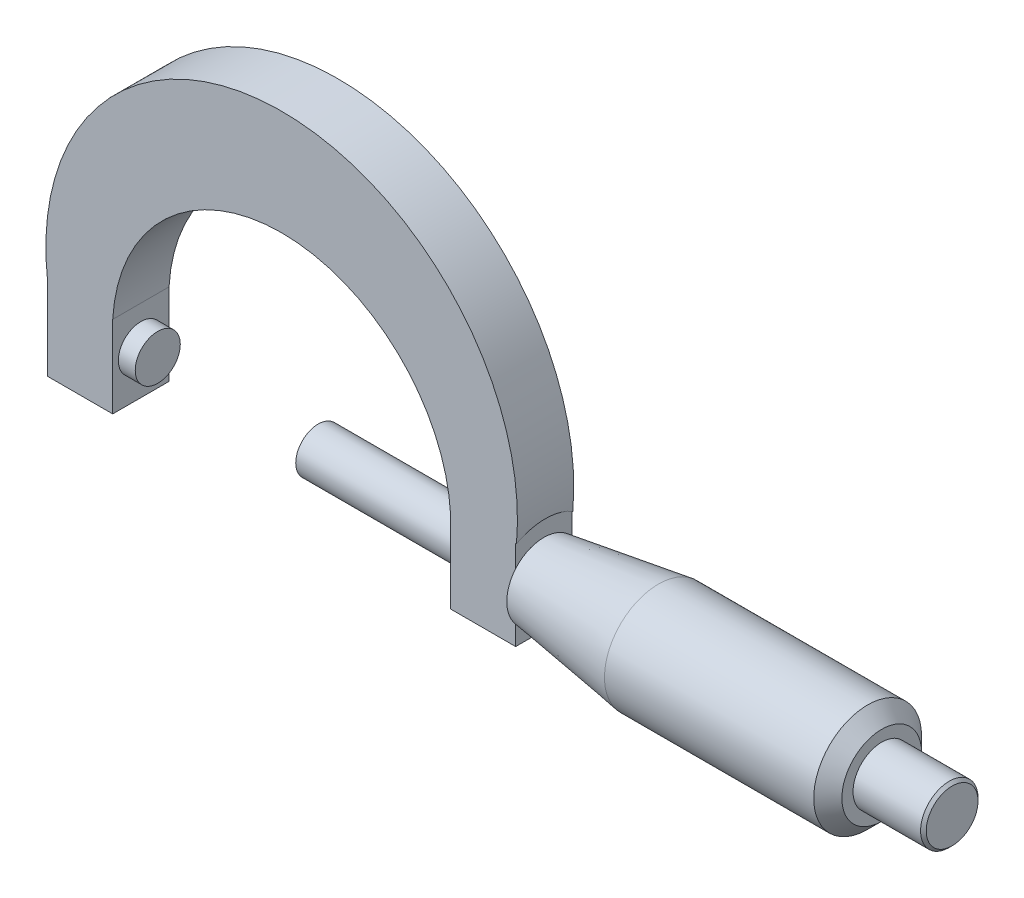
ISO-10303-21;
HEADER;
FILE_DESCRIPTION(('STEP AP214'),'2;1');
FILE_NAME('part.step','',(''),(''),'','','');
FILE_SCHEMA(('AUTOMOTIVE_DESIGN { 1 0 10303 214 1 1 1 1 }'));
ENDSEC;
DATA;
#1=APPLICATION_CONTEXT('core data for automotive mechanical design processes');
#2=APPLICATION_PROTOCOL_DEFINITION('international standard','automotive_design',2000,#1);
#3=PRODUCT_CONTEXT('',#1,'mechanical');
#4=PRODUCT('Part','Part','',(#3));
#5=PRODUCT_RELATED_PRODUCT_CATEGORY('part','',(#4));
#6=PRODUCT_DEFINITION_FORMATION('','',#4);
#7=PRODUCT_DEFINITION_CONTEXT('part definition',#1,'design');
#8=PRODUCT_DEFINITION('design','',#6,#7);
#9=PRODUCT_DEFINITION_SHAPE('','',#8);
#10=(LENGTH_UNIT() NAMED_UNIT(*) SI_UNIT(.MILLI.,.METRE.));
#11=(NAMED_UNIT(*) PLANE_ANGLE_UNIT() SI_UNIT($,.RADIAN.));
#12=(NAMED_UNIT(*) SI_UNIT($,.STERADIAN.) SOLID_ANGLE_UNIT());
#13=UNCERTAINTY_MEASURE_WITH_UNIT(LENGTH_MEASURE(1.E-05),#10,'distance_accuracy_value','');
#14=(GEOMETRIC_REPRESENTATION_CONTEXT(3) GLOBAL_UNCERTAINTY_ASSIGNED_CONTEXT((#13)) GLOBAL_UNIT_ASSIGNED_CONTEXT((#10,
#11,#12)) REPRESENTATION_CONTEXT('',''));
#15=CARTESIAN_POINT('',(0.,0.,0.));
#16=DIRECTION('',(0.,0.,1.));
#17=DIRECTION('',(1.,0.,0.));
#18=AXIS2_PLACEMENT_3D('',#15,#16,#17);
#19=CARTESIAN_POINT('',(21.1105102041848,0.,0.));
#20=DIRECTION('',(1.,0.,0.));
#21=DIRECTION('',(0.,0.,-1.));
#22=AXIS2_PLACEMENT_3D('',#19,#20,#21);
#23=PLANE('',#22);
#24=DIRECTION('',(0.,-1.,0.));
#25=VECTOR('',#24,1.);
#26=CARTESIAN_POINT('',(21.1105102041848,-3.91655101886085,2.53999999999999));
#27=LINE('',#26,#25);
#28=CARTESIAN_POINT('',(21.1105102041848,2.17259672592934,2.53999999999999));
#29=VERTEX_POINT('',#28);
#30=CARTESIAN_POINT('',(21.1105102041848,-2.17259672592934,2.53999999999999));
#31=VERTEX_POINT('',#30);
#32=EDGE_CURVE('E192',#29,#31,#27,.T.);
#33=ORIENTED_EDGE('',*,*,#32,.T.);
#34=CARTESIAN_POINT('',(21.1105102041848,0.,0.));
#35=DIRECTION('',(1.,0.,0.));
#36=DIRECTION('',(0.,0.,-1.));
#37=AXIS2_PLACEMENT_3D('',#34,#35,#36);
#38=CIRCLE('',#37,3.34242075949737);
#39=EDGE_CURVE('E149',#31,#29,#38,.F.);
#40=ORIENTED_EDGE('',*,*,#39,.T.);
#41=EDGE_LOOP('',(#33,#40));
#42=FACE_BOUND('',#41,.T.);
#43=ADVANCED_FACE('F48',(#42),#23,.F.);
#44=DIRECTION('',(0.,-1.,0.));
#45=VECTOR('',#44,1.);
#46=CARTESIAN_POINT('',(21.1105102041848,-3.91655101886085,-2.53999999999999));
#47=LINE('',#46,#45);
#48=CARTESIAN_POINT('',(21.1105102041848,2.17259672592934,-2.53999999999999));
#49=VERTEX_POINT('',#48);
#50=CARTESIAN_POINT('',(21.1105102041848,-2.17259672592934,-2.53999999999999));
#51=VERTEX_POINT('',#50);
#52=EDGE_CURVE('E162',#49,#51,#47,.T.);
#53=ORIENTED_EDGE('',*,*,#52,.F.);
#54=EDGE_CURVE('E141',#49,#51,#38,.F.);
#55=ORIENTED_EDGE('',*,*,#54,.T.);
#56=EDGE_LOOP('',(#53,#55));
#57=FACE_BOUND('',#56,.T.);
#58=ADVANCED_FACE('F163',(#57),#23,.F.);
#59=CARTESIAN_POINT('',(0.,6.08361904921517,2.53999999999999));
#60=DIRECTION('',(0.,0.,-1.));
#61=DIRECTION('',(-1.,0.,0.));
#62=AXIS2_PLACEMENT_3D('',#59,#60,#61);
#63=CYLINDRICAL_SURFACE('',#62,21.2716639108442);
#64=CARTESIAN_POINT('',(21.1835693484904,4.14969164788681,-2.53999999999999));
#65=CARTESIAN_POINT('',(21.1900594321899,4.22084179336612,-2.4237895843987));
#66=CARTESIAN_POINT('',(21.1957521620569,4.28710102614201,-2.30454559752916));
#67=CARTESIAN_POINT('',(21.2057660920018,4.40940344393565,-2.06088371676479));
#68=CARTESIAN_POINT('',(21.2100873902017,4.46544735970749,-1.93646619374216));
#69=CARTESIAN_POINT('',(21.217578525215,4.566841433471,-1.6834678172283));
#70=CARTESIAN_POINT('',(21.2207495783246,4.61220286945297,-1.55489151899811));
#71=CARTESIAN_POINT('',(21.2261310367689,4.69198297696004,-1.29436958269521));
#72=CARTESIAN_POINT('',(21.2283414498489,4.72640173671258,-1.1624239717975));
#73=CARTESIAN_POINT('',(21.2319486009122,4.78405053126495,-0.896085379426133));
#74=CARTESIAN_POINT('',(21.2333452529681,4.80727938444812,-0.761692141045593));
#75=CARTESIAN_POINT('',(21.2354262515351,4.84238268823947,-0.491378078538447));
#76=CARTESIAN_POINT('',(21.2361103506572,4.85425319526546,-0.355456740419877));
#77=CARTESIAN_POINT('',(21.2368181706322,4.86654157270807,-0.0830773739447107));
#78=CARTESIAN_POINT('',(21.2368418028732,4.86695790636813,0.0533807239703093));
#79=CARTESIAN_POINT('',(21.2362303107757,4.85633105646733,0.325848540945894));
#80=CARTESIAN_POINT('',(21.2355951862726,4.84528787004251,0.461858259894392));
#81=CARTESIAN_POINT('',(21.2336146602867,4.8117794868267,0.732802056394959));
#82=CARTESIAN_POINT('',(21.232267494618,4.78928592518832,0.867732613481041));
#83=CARTESIAN_POINT('',(21.2287634235388,4.7330333626168,1.13516490620752));
#84=CARTESIAN_POINT('',(21.226606807464,4.6992783875213,1.26766749199037));
#85=CARTESIAN_POINT('',(21.2213424472608,4.62079511828172,1.52918662586984));
#86=CARTESIAN_POINT('',(21.2182358349832,4.57607989498384,1.65820712461491));
#87=CARTESIAN_POINT('',(21.2108876315182,4.47599785235108,1.91195415444147));
#88=CARTESIAN_POINT('',(21.2066466465006,4.42063672624997,2.03668293880918));
#89=CARTESIAN_POINT('',(21.1991095524013,4.32791879312793,2.22394824292263));
#90=CARTESIAN_POINT('',(21.1962963634971,4.29421940998132,2.28833980358012));
#91=CARTESIAN_POINT('',(21.1902541161794,4.22403518427134,2.41543546447965));
#92=CARTESIAN_POINT('',(21.1870257122975,4.18755476174528,2.47814203670694));
#93=CARTESIAN_POINT('',(21.1835693484904,4.14969164788681,2.53999999999999));
#94=B_SPLINE_CURVE_WITH_KNOTS('',3,(#64,#65,#66,#67,#68,#69,#70,#71,#72,#73,#74,#75,#76,#77,#78,
#79,#80,#81,#82,#83,#84,#85,#86,#87,#88,#89,#90,#91,#92,#93),.UNSPECIFIED.,.F.,.F.,(4,2,2,2,2,2,
2,2,2,2,2,2,2,2,4),(0.,0.409119300168258,0.818209322436453,1.22686549349714,1.63551836960575,
2.04421438863619,2.45305225421095,2.8619449715146,3.27083779100886,3.68074848421016,
4.0905127953642,4.49979079202601,4.90885051995993,5.12697906246959,5.34476787459816),.UNSPECIFIED.);
#95=CARTESIAN_POINT('',(21.1835693484904,4.14969164788681,-2.53999999999999));
#96=VERTEX_POINT('',#95);
#97=CARTESIAN_POINT('',(21.1835693484904,4.14969164788681,2.53999999999999));
#98=VERTEX_POINT('',#97);
#99=EDGE_CURVE('E178',#96,#98,#94,.T.);
#100=ORIENTED_EDGE('',*,*,#99,.F.);
#101=CARTESIAN_POINT('',(0.,6.08361904921517,-2.53999999999999));
#102=DIRECTION('',(0.,0.,1.));
#103=DIRECTION('',(-1.,0.,0.));
#104=AXIS2_PLACEMENT_3D('',#101,#102,#103);
#105=CIRCLE('',#104,21.2716639108442);
#106=CARTESIAN_POINT('',(-21.1105102041848,3.47018367505278,-2.53999999999999));
#107=VERTEX_POINT('',#106);
#108=EDGE_CURVE('E94',#96,#107,#105,.T.);
#109=ORIENTED_EDGE('',*,*,#108,.T.);
#110=DIRECTION('',(0.,0.,-1.));
#111=VECTOR('',#110,1.);
#112=CARTESIAN_POINT('',(-21.1105102041848,3.47018367505278,2.53999999999999));
#113=LINE('',#112,#111);
#114=CARTESIAN_POINT('',(-21.1105102041848,3.47018367505278,2.53999999999999));
#115=VERTEX_POINT('',#114);
#116=EDGE_CURVE('E219',#115,#107,#113,.T.);
#117=ORIENTED_EDGE('',*,*,#116,.F.);
#118=CARTESIAN_POINT('',(0.,6.08361904921517,2.53999999999999));
#119=DIRECTION('',(0.,0.,1.));
#120=DIRECTION('',(-1.,0.,0.));
#121=AXIS2_PLACEMENT_3D('',#118,#119,#120);
#122=CIRCLE('',#121,21.2716639108442);
#123=EDGE_CURVE('E72',#98,#115,#122,.T.);
#124=ORIENTED_EDGE('',*,*,#123,.F.);
#125=EDGE_LOOP('',(#100,#109,#117,#124));
#126=FACE_BOUND('',#125,.T.);
#127=ADVANCED_FACE('F274',(#126),#63,.T.);
#128=CARTESIAN_POINT('',(0.,6.08361904921517,2.53999999999999));
#129=DIRECTION('',(0.,0.,-1.));
#130=DIRECTION('',(-1.,0.,0.));
#131=AXIS2_PLACEMENT_3D('',#128,#129,#130);
#132=PLANE('',#131);
#133=DIRECTION('',(-1.,0.,0.));
#134=VECTOR('',#133,1.);
#135=CARTESIAN_POINT('',(51.5905102041848,4.14969164788681,2.53999999999999));
#136=LINE('',#135,#134);
#137=CARTESIAN_POINT('',(21.1105102041848,4.14969164788681,2.53999999999999));
#138=VERTEX_POINT('',#137);
#139=EDGE_CURVE('E175',#98,#138,#136,.T.);
#140=ORIENTED_EDGE('',*,*,#139,.F.);
#141=ORIENTED_EDGE('',*,*,#123,.T.);
#142=DIRECTION('',(0.,-1.,0.));
#143=VECTOR('',#142,1.);
#144=CARTESIAN_POINT('',(-21.1105102041848,-3.91655101886085,2.53999999999999));
#145=LINE('',#144,#143);
#146=CARTESIAN_POINT('',(-21.1105102041848,-3.91655101886085,2.53999999999999));
#147=VERTEX_POINT('',#146);
#148=EDGE_CURVE('E211',#115,#147,#145,.T.);
#149=ORIENTED_EDGE('',*,*,#148,.T.);
#150=DIRECTION('',(1.,0.,0.));
#151=VECTOR('',#150,1.);
#152=CARTESIAN_POINT('',(-21.1105102041848,-3.91655101886085,2.53999999999999));
#153=LINE('',#152,#151);
#154=CARTESIAN_POINT('',(-15.2400000000744,-3.91655101886085,2.53999999999999));
#155=VERTEX_POINT('',#154);
#156=EDGE_CURVE('E102',#147,#155,#153,.T.);
#157=ORIENTED_EDGE('',*,*,#156,.T.);
#158=DIRECTION('',(0.,1.,0.));
#159=VECTOR('',#158,1.);
#160=CARTESIAN_POINT('',(-15.2400000000744,-3.91655101886085,2.53999999999999));
#161=LINE('',#160,#159);
#162=CARTESIAN_POINT('',(-15.2400000000744,3.47018367505281,2.53999999999999));
#163=VERTEX_POINT('',#162);
#164=EDGE_CURVE('E214',#155,#163,#161,.T.);
#165=ORIENTED_EDGE('',*,*,#164,.T.);
#166=CARTESIAN_POINT('',(0.,2.5933282814625,2.53999999999999));
#167=DIRECTION('',(0.,0.,-1.));
#168=DIRECTION('',(-1.,0.,0.));
#169=AXIS2_PLACEMENT_3D('',#166,#167,#168);
#170=CIRCLE('',#169,15.2652047278619);
#171=CARTESIAN_POINT('',(15.2400000000744,3.47018367505281,2.53999999999999));
#172=VERTEX_POINT('',#171);
#173=EDGE_CURVE('E216',#163,#172,#170,.T.);
#174=ORIENTED_EDGE('',*,*,#173,.T.);
#175=DIRECTION('',(0.,1.,0.));
#176=VECTOR('',#175,1.);
#177=CARTESIAN_POINT('',(15.2400000000744,-3.91655101886085,2.53999999999999));
#178=LINE('',#177,#176);
#179=CARTESIAN_POINT('',(15.2400000000744,-3.91655101886085,2.53999999999999));
#180=VERTEX_POINT('',#179);
#181=EDGE_CURVE('E191',#180,#172,#178,.T.);
#182=ORIENTED_EDGE('',*,*,#181,.F.);
#183=DIRECTION('',(-1.,0.,0.));
#184=VECTOR('',#183,1.);
#185=CARTESIAN_POINT('',(21.1105102041848,-3.91655101886085,2.53999999999999));
#186=LINE('',#185,#184);
#187=CARTESIAN_POINT('',(21.1105102041848,-3.91655101886085,2.53999999999999));
#188=VERTEX_POINT('',#187);
#189=EDGE_CURVE('E195',#188,#180,#186,.T.);
#190=ORIENTED_EDGE('',*,*,#189,.F.);
#191=EDGE_CURVE('E193',#31,#188,#27,.T.);
#192=ORIENTED_EDGE('',*,*,#191,.F.);
#193=ORIENTED_EDGE('',*,*,#32,.F.);
#194=EDGE_CURVE('E159',#138,#29,#27,.T.);
#195=ORIENTED_EDGE('',*,*,#194,.F.);
#196=EDGE_LOOP('',(#140,#141,#149,#157,#165,#174,#182,#190,#192,#193,#195));
#197=FACE_BOUND('',#196,.T.);
#198=ADVANCED_FACE('F292',(#197),#132,.F.);
#199=CARTESIAN_POINT('',(0.,6.08361904921517,-2.53999999999999));
#200=DIRECTION('',(0.,0.,-1.));
#201=DIRECTION('',(-1.,0.,0.));
#202=AXIS2_PLACEMENT_3D('',#199,#200,#201);
#203=PLANE('',#202);
#204=ORIENTED_EDGE('',*,*,#108,.F.);
#205=DIRECTION('',(-1.,0.,0.));
#206=VECTOR('',#205,1.);
#207=CARTESIAN_POINT('',(51.5905102041848,4.14969164788681,-2.53999999999999));
#208=LINE('',#207,#206);
#209=CARTESIAN_POINT('',(21.1105102041848,4.14969164788681,-2.53999999999999));
#210=VERTEX_POINT('',#209);
#211=EDGE_CURVE('E150',#96,#210,#208,.T.);
#212=ORIENTED_EDGE('',*,*,#211,.T.);
#213=EDGE_CURVE('E156',#210,#49,#47,.T.);
#214=ORIENTED_EDGE('',*,*,#213,.T.);
#215=ORIENTED_EDGE('',*,*,#52,.T.);
#216=CARTESIAN_POINT('',(21.1105102041848,-3.91655101886085,-2.53999999999999));
#217=VERTEX_POINT('',#216);
#218=EDGE_CURVE('E166',#51,#217,#47,.T.);
#219=ORIENTED_EDGE('',*,*,#218,.T.);
#220=DIRECTION('',(-1.,0.,0.));
#221=VECTOR('',#220,1.);
#222=CARTESIAN_POINT('',(21.1105102041848,-3.91655101886085,-2.53999999999999));
#223=LINE('',#222,#221);
#224=CARTESIAN_POINT('',(15.2400000000744,-3.91655101886085,-2.53999999999999));
#225=VERTEX_POINT('',#224);
#226=EDGE_CURVE('E172',#217,#225,#223,.T.);
#227=ORIENTED_EDGE('',*,*,#226,.T.);
#228=DIRECTION('',(0.,1.,0.));
#229=VECTOR('',#228,1.);
#230=CARTESIAN_POINT('',(15.2400000000744,-3.91655101886085,-2.53999999999999));
#231=LINE('',#230,#229);
#232=CARTESIAN_POINT('',(15.2400000000744,3.47018367505281,-2.53999999999999));
#233=VERTEX_POINT('',#232);
#234=EDGE_CURVE('E170',#225,#233,#231,.T.);
#235=ORIENTED_EDGE('',*,*,#234,.T.);
#236=CARTESIAN_POINT('',(0.,2.5933282814625,-2.53999999999999));
#237=DIRECTION('',(0.,0.,-1.));
#238=DIRECTION('',(-1.,0.,0.));
#239=AXIS2_PLACEMENT_3D('',#236,#237,#238);
#240=CIRCLE('',#239,15.2652047278619);
#241=CARTESIAN_POINT('',(-15.2400000000744,3.47018367505281,-2.53999999999999));
#242=VERTEX_POINT('',#241);
#243=EDGE_CURVE('E226',#242,#233,#240,.T.);
#244=ORIENTED_EDGE('',*,*,#243,.F.);
#245=DIRECTION('',(0.,1.,0.));
#246=VECTOR('',#245,1.);
#247=CARTESIAN_POINT('',(-15.2400000000744,-3.91655101886085,-2.53999999999999));
#248=LINE('',#247,#246);
#249=CARTESIAN_POINT('',(-15.2400000000744,-3.91655101886085,-2.53999999999999));
#250=VERTEX_POINT('',#249);
#251=EDGE_CURVE('E224',#250,#242,#248,.T.);
#252=ORIENTED_EDGE('',*,*,#251,.F.);
#253=DIRECTION('',(1.,0.,0.));
#254=VECTOR('',#253,1.);
#255=CARTESIAN_POINT('',(-21.1105102041848,-3.91655101886085,-2.53999999999999));
#256=LINE('',#255,#254);
#257=CARTESIAN_POINT('',(-21.1105102041848,-3.91655101886085,-2.53999999999999));
#258=VERTEX_POINT('',#257);
#259=EDGE_CURVE('E222',#258,#250,#256,.T.);
#260=ORIENTED_EDGE('',*,*,#259,.F.);
#261=DIRECTION('',(0.,-1.,0.));
#262=VECTOR('',#261,1.);
#263=CARTESIAN_POINT('',(-21.1105102041848,-3.91655101886085,-2.53999999999999));
#264=LINE('',#263,#262);
#265=EDGE_CURVE('E210',#107,#258,#264,.T.);
#266=ORIENTED_EDGE('',*,*,#265,.F.);
#267=EDGE_LOOP('',(#204,#212,#214,#215,#219,#227,#235,#244,#252,#260,#266));
#268=FACE_BOUND('',#267,.T.);
#269=ADVANCED_FACE('F169',(#268),#203,.T.);
#270=CARTESIAN_POINT('',(-21.1105102041848,-3.91655101886085,2.53999999999999));
#271=DIRECTION('',(1.,0.,0.));
#272=DIRECTION('',(0.,0.,-1.));
#273=AXIS2_PLACEMENT_3D('',#270,#271,#272);
#274=PLANE('',#273);
#275=ORIENTED_EDGE('',*,*,#265,.T.);
#276=DIRECTION('',(0.,0.,-1.));
#277=VECTOR('',#276,1.);
#278=CARTESIAN_POINT('',(-21.1105102041848,-3.91655101886085,2.53999999999999));
#279=LINE('',#278,#277);
#280=EDGE_CURVE('E236',#147,#258,#279,.T.);
#281=ORIENTED_EDGE('',*,*,#280,.F.);
#282=ORIENTED_EDGE('',*,*,#148,.F.);
#283=ORIENTED_EDGE('',*,*,#116,.T.);
#284=EDGE_LOOP('',(#275,#281,#282,#283));
#285=FACE_BOUND('',#284,.T.);
#286=ADVANCED_FACE('F296',(#285),#274,.F.);
#287=CARTESIAN_POINT('',(-21.1105102041848,-3.91655101886085,2.53999999999999));
#288=DIRECTION('',(0.,1.,0.));
#289=DIRECTION('',(0.,0.,1.));
#290=AXIS2_PLACEMENT_3D('',#287,#288,#289);
#291=PLANE('',#290);
#292=ORIENTED_EDGE('',*,*,#259,.T.);
#293=DIRECTION('',(0.,0.,-1.));
#294=VECTOR('',#293,1.);
#295=CARTESIAN_POINT('',(-15.2400000000744,-3.91655101886085,2.53999999999999));
#296=LINE('',#295,#294);
#297=EDGE_CURVE('E233',#155,#250,#296,.T.);
#298=ORIENTED_EDGE('',*,*,#297,.F.);
#299=ORIENTED_EDGE('',*,*,#156,.F.);
#300=ORIENTED_EDGE('',*,*,#280,.T.);
#301=EDGE_LOOP('',(#292,#298,#299,#300));
#302=FACE_BOUND('',#301,.T.);
#303=ADVANCED_FACE('F306',(#302),#291,.F.);
#304=CARTESIAN_POINT('',(-15.2400000000744,-3.91655101886085,2.53999999999999));
#305=DIRECTION('',(-1.,0.,0.));
#306=DIRECTION('',(0.,0.,1.));
#307=AXIS2_PLACEMENT_3D('',#304,#305,#306);
#308=PLANE('',#307);
#309=CARTESIAN_POINT('',(-15.2400000000744,0.,0.));
#310=DIRECTION('',(-1.,0.,0.));
#311=DIRECTION('',(0.,0.,1.));
#312=AXIS2_PLACEMENT_3D('',#309,#310,#311);
#313=CIRCLE('',#312,2.032);
#314=CARTESIAN_POINT('',(-15.2400000000744,0.,2.032));
#315=VERTEX_POINT('',#314);
#316=EDGE_CURVE('E13',#315,#315,#313,.F.);
#317=ORIENTED_EDGE('',*,*,#316,.F.);
#318=EDGE_LOOP('',(#317));
#319=FACE_BOUND('',#318,.T.);
#320=ORIENTED_EDGE('',*,*,#251,.T.);
#321=DIRECTION('',(0.,0.,-1.));
#322=VECTOR('',#321,1.);
#323=CARTESIAN_POINT('',(-15.2400000000744,3.47018367505281,2.53999999999999));
#324=LINE('',#323,#322);
#325=EDGE_CURVE('E230',#163,#242,#324,.T.);
#326=ORIENTED_EDGE('',*,*,#325,.F.);
#327=ORIENTED_EDGE('',*,*,#164,.F.);
#328=ORIENTED_EDGE('',*,*,#297,.T.);
#329=EDGE_LOOP('',(#320,#326,#327,#328));
#330=FACE_BOUND('',#329,.T.);
#331=ADVANCED_FACE('F302',(#319,#330),#308,.F.);
#332=CARTESIAN_POINT('',(0.,2.5933282814625,2.53999999999999));
#333=DIRECTION('',(0.,0.,-1.));
#334=DIRECTION('',(-1.,0.,0.));
#335=AXIS2_PLACEMENT_3D('',#332,#333,#334);
#336=CYLINDRICAL_SURFACE('',#335,15.2652047278619);
#337=ORIENTED_EDGE('',*,*,#243,.T.);
#338=DIRECTION('',(0.,0.,-1.));
#339=VECTOR('',#338,1.);
#340=CARTESIAN_POINT('',(15.2400000000744,3.47018367505281,2.53999999999999));
#341=LINE('',#340,#339);
#342=EDGE_CURVE('E204',#172,#233,#341,.T.);
#343=ORIENTED_EDGE('',*,*,#342,.F.);
#344=ORIENTED_EDGE('',*,*,#173,.F.);
#345=ORIENTED_EDGE('',*,*,#325,.T.);
#346=EDGE_LOOP('',(#337,#343,#344,#345));
#347=FACE_BOUND('',#346,.T.);
#348=ADVANCED_FACE('F290',(#347),#336,.F.);
#349=CARTESIAN_POINT('',(15.2400000000744,-3.91655101886085,2.53999999999999));
#350=DIRECTION('',(-1.,0.,0.));
#351=DIRECTION('',(0.,0.,1.));
#352=AXIS2_PLACEMENT_3D('',#349,#350,#351);
#353=PLANE('',#352);
#354=CARTESIAN_POINT('',(15.2400000000744,0.,0.));
#355=DIRECTION('',(-1.,0.,0.));
#356=DIRECTION('',(0.,0.,1.));
#357=AXIS2_PLACEMENT_3D('',#354,#355,#356);
#358=CIRCLE('',#357,2.032);
#359=CARTESIAN_POINT('',(15.2400000000744,0.,2.032));
#360=VERTEX_POINT('',#359);
#361=EDGE_CURVE('E420',#360,#360,#358,.T.);
#362=ORIENTED_EDGE('',*,*,#361,.F.);
#363=EDGE_LOOP('',(#362));
#364=FACE_BOUND('',#363,.T.);
#365=ORIENTED_EDGE('',*,*,#234,.F.);
#366=DIRECTION('',(0.,0.,-1.));
#367=VECTOR('',#366,1.);
#368=CARTESIAN_POINT('',(15.2400000000744,-3.91655101886085,2.53999999999999));
#369=LINE('',#368,#367);
#370=EDGE_CURVE('E201',#180,#225,#369,.T.);
#371=ORIENTED_EDGE('',*,*,#370,.F.);
#372=ORIENTED_EDGE('',*,*,#181,.T.);
#373=ORIENTED_EDGE('',*,*,#342,.T.);
#374=EDGE_LOOP('',(#365,#371,#372,#373));
#375=FACE_BOUND('',#374,.T.);
#376=ADVANCED_FACE('F287',(#364,#375),#353,.T.);
#377=CARTESIAN_POINT('',(21.1105102041848,-3.91655101886085,2.53999999999999));
#378=DIRECTION('',(0.,-1.,0.));
#379=DIRECTION('',(0.,0.,-1.));
#380=AXIS2_PLACEMENT_3D('',#377,#378,#379);
#381=PLANE('',#380);
#382=ORIENTED_EDGE('',*,*,#226,.F.);
#383=DIRECTION('',(0.,0.,-1.));
#384=VECTOR('',#383,1.);
#385=CARTESIAN_POINT('',(21.1105102041848,-3.91655101886085,2.53999999999999));
#386=LINE('',#385,#384);
#387=EDGE_CURVE('E197',#188,#217,#386,.T.);
#388=ORIENTED_EDGE('',*,*,#387,.F.);
#389=ORIENTED_EDGE('',*,*,#189,.T.);
#390=ORIENTED_EDGE('',*,*,#370,.T.);
#391=EDGE_LOOP('',(#382,#388,#389,#390));
#392=FACE_BOUND('',#391,.T.);
#393=ADVANCED_FACE('F284',(#392),#381,.T.);
#394=CARTESIAN_POINT('',(21.1105102041848,3.34242075949737,0.));
#395=DIRECTION('',(-1.,0.,0.));
#396=DIRECTION('',(0.,0.,1.));
#397=AXIS2_PLACEMENT_3D('',#394,#395,#396);
#398=PLANE('',#397);
#399=CARTESIAN_POINT('',(21.1105102041848,0.,0.));
#400=DIRECTION('',(1.,0.,0.));
#401=DIRECTION('',(0.,0.,-1.));
#402=AXIS2_PLACEMENT_3D('',#399,#400,#401);
#403=CIRCLE('',#402,3.34242075949737);
#404=EDGE_CURVE('E144',#49,#29,#403,.T.);
#405=ORIENTED_EDGE('',*,*,#404,.F.);
#406=ORIENTED_EDGE('',*,*,#213,.F.);
#407=CARTESIAN_POINT('',(21.1105102041848,0.,0.));
#408=DIRECTION('',(1.,0.,0.));
#409=DIRECTION('',(0.,0.,-1.));
#410=AXIS2_PLACEMENT_3D('',#407,#408,#409);
#411=CIRCLE('',#410,4.86534076633299);
#412=EDGE_CURVE('E160',#210,#138,#411,.T.);
#413=ORIENTED_EDGE('',*,*,#412,.T.);
#414=ORIENTED_EDGE('',*,*,#194,.T.);
#415=EDGE_LOOP('',(#405,#406,#413,#414));
#416=FACE_BOUND('',#415,.T.);
#417=ADVANCED_FACE('F153',(#416),#398,.F.);
#418=ORIENTED_EDGE('',*,*,#387,.T.);
#419=ORIENTED_EDGE('',*,*,#218,.F.);
#420=EDGE_CURVE('E63',#31,#51,#403,.T.);
#421=ORIENTED_EDGE('',*,*,#420,.F.);
#422=ORIENTED_EDGE('',*,*,#191,.T.);
#423=EDGE_LOOP('',(#418,#419,#421,#422));
#424=FACE_BOUND('',#423,.T.);
#425=ADVANCED_FACE('F353',(#424),#398,.F.);
#426=CARTESIAN_POINT('',(51.5905102041848,0.,0.));
#427=DIRECTION('',(1.,0.,0.));
#428=DIRECTION('',(0.,0.,-1.));
#429=AXIS2_PLACEMENT_3D('',#426,#427,#428);
#430=CYLINDRICAL_SURFACE('',#429,4.86534076633299);
#431=ORIENTED_EDGE('',*,*,#412,.F.);
#432=ORIENTED_EDGE('',*,*,#211,.F.);
#433=ORIENTED_EDGE('',*,*,#99,.T.);
#434=ORIENTED_EDGE('',*,*,#139,.T.);
#435=EDGE_LOOP('',(#431,#432,#433,#434));
#436=FACE_BOUND('',#435,.T.);
#437=ADVANCED_FACE('F325',(#436),#430,.F.);
#438=CARTESIAN_POINT('',(21.1105102041848,0.,0.));
#439=DIRECTION('',(1.,0.,0.));
#440=DIRECTION('',(0.,0.,-1.));
#441=AXIS2_PLACEMENT_3D('',#438,#439,#440);
#442=CONICAL_SURFACE('',#441,3.34242075949737,0.146297324440882);
#443=CARTESIAN_POINT('',(31.4458974460131,0.,0.));
#444=DIRECTION('',(1.,0.,0.));
#445=DIRECTION('',(0.,0.,-1.));
#446=AXIS2_PLACEMENT_3D('',#443,#444,#445);
#447=CIRCLE('',#446,4.86534076633299);
#448=CARTESIAN_POINT('',(31.4458974460131,0.,-4.86534076633299));
#449=VERTEX_POINT('',#448);
#450=EDGE_CURVE('E335',#449,#449,#447,.T.);
#451=ORIENTED_EDGE('',*,*,#450,.F.);
#452=EDGE_LOOP('',(#451));
#453=FACE_BOUND('',#452,.T.);
#454=ORIENTED_EDGE('',*,*,#404,.T.);
#455=ORIENTED_EDGE('',*,*,#39,.F.);
#456=ORIENTED_EDGE('',*,*,#420,.T.);
#457=ORIENTED_EDGE('',*,*,#54,.F.);
#458=EDGE_LOOP('',(#454,#455,#456,#457));
#459=FACE_BOUND('',#458,.T.);
#460=ADVANCED_FACE('F143',(#453,#459),#442,.T.);
#461=CARTESIAN_POINT('',(51.5905102041848,0.,0.));
#462=DIRECTION('',(1.,0.,0.));
#463=DIRECTION('',(0.,0.,-1.));
#464=AXIS2_PLACEMENT_3D('',#461,#462,#463);
#465=PLANE('',#464);
#466=CARTESIAN_POINT('',(51.5905102041848,0.,0.));
#467=DIRECTION('',(1.,0.,0.));
#468=DIRECTION('',(0.,0.,-1.));
#469=AXIS2_PLACEMENT_3D('',#466,#467,#468);
#470=CIRCLE('',#469,2.59008251069091);
#471=CARTESIAN_POINT('',(51.5905102041848,0.,-2.59008251069091));
#472=VERTEX_POINT('',#471);
#473=EDGE_CURVE('E245',#472,#472,#470,.T.);
#474=ORIENTED_EDGE('',*,*,#473,.F.);
#475=EDGE_LOOP('',(#474));
#476=FACE_BOUND('',#475,.T.);
#477=CARTESIAN_POINT('',(51.5905102041848,0.,0.));
#478=DIRECTION('',(1.,0.,0.));
#479=DIRECTION('',(0.,0.,-1.));
#480=AXIS2_PLACEMENT_3D('',#477,#478,#479);
#481=CIRCLE('',#480,3.59534076633299);
#482=CARTESIAN_POINT('',(51.5905102041848,0.,-3.59534076633299));
#483=VERTEX_POINT('',#482);
#484=EDGE_CURVE('E239',#483,#483,#481,.T.);
#485=ORIENTED_EDGE('',*,*,#484,.T.);
#486=EDGE_LOOP('',(#485));
#487=FACE_BOUND('',#486,.T.);
#488=ADVANCED_FACE('F277',(#476,#487),#465,.T.);
#489=CARTESIAN_POINT('',(51.5905102041848,0.,0.));
#490=DIRECTION('',(-1.,0.,0.));
#491=DIRECTION('',(0.,0.,1.));
#492=AXIS2_PLACEMENT_3D('',#489,#490,#491);
#493=CYLINDRICAL_SURFACE('',#492,4.86534076633299);
#494=CARTESIAN_POINT('',(50.3205102041848,0.,0.));
#495=DIRECTION('',(1.,0.,0.));
#496=DIRECTION('',(0.,0.,-1.));
#497=AXIS2_PLACEMENT_3D('',#494,#495,#496);
#498=CIRCLE('',#497,4.86534076633299);
#499=CARTESIAN_POINT('',(50.3205102041848,0.,-4.86534076633299));
#500=VERTEX_POINT('',#499);
#501=EDGE_CURVE('E242',#500,#500,#498,.F.);
#502=ORIENTED_EDGE('',*,*,#501,.T.);
#503=EDGE_LOOP('',(#502));
#504=FACE_BOUND('',#503,.T.);
#505=ORIENTED_EDGE('',*,*,#450,.T.);
#506=EDGE_LOOP('',(#505));
#507=FACE_BOUND('',#506,.T.);
#508=ADVANCED_FACE('F279',(#504,#507),#493,.T.);
#509=CARTESIAN_POINT('',(51.5905102041848,0.,0.));
#510=DIRECTION('',(-1.,0.,0.));
#511=DIRECTION('',(0.,0.,1.));
#512=AXIS2_PLACEMENT_3D('',#509,#510,#511);
#513=CONICAL_SURFACE('',#512,3.59534076633299,0.785398163397447);
#514=ORIENTED_EDGE('',*,*,#501,.F.);
#515=EDGE_LOOP('',(#514));
#516=FACE_BOUND('',#515,.T.);
#517=ORIENTED_EDGE('',*,*,#484,.F.);
#518=EDGE_LOOP('',(#517));
#519=FACE_BOUND('',#518,.T.);
#520=ADVANCED_FACE('F265',(#516,#519),#513,.T.);
#521=CARTESIAN_POINT('',(57.9405102041849,0.,0.));
#522=DIRECTION('',(-1.,0.,0.));
#523=DIRECTION('',(0.,0.,1.));
#524=AXIS2_PLACEMENT_3D('',#521,#522,#523);
#525=CYLINDRICAL_SURFACE('',#524,2.59008251069091);
#526=CARTESIAN_POINT('',(57.6865102041849,0.,0.));
#527=DIRECTION('',(1.,0.,0.));
#528=DIRECTION('',(0.,0.,-1.));
#529=AXIS2_PLACEMENT_3D('',#526,#527,#528);
#530=CIRCLE('',#529,2.59008251069091);
#531=CARTESIAN_POINT('',(57.6865102041849,0.,-2.59008251069091));
#532=VERTEX_POINT('',#531);
#533=EDGE_CURVE('E56',#532,#532,#530,.F.);
#534=ORIENTED_EDGE('',*,*,#533,.T.);
#535=EDGE_LOOP('',(#534));
#536=FACE_BOUND('',#535,.T.);
#537=ORIENTED_EDGE('',*,*,#473,.T.);
#538=EDGE_LOOP('',(#537));
#539=FACE_BOUND('',#538,.T.);
#540=ADVANCED_FACE('F251',(#536,#539),#525,.T.);
#541=CARTESIAN_POINT('',(57.9405102041849,0.,0.));
#542=DIRECTION('',(1.,0.,0.));
#543=DIRECTION('',(0.,0.,-1.));
#544=AXIS2_PLACEMENT_3D('',#541,#542,#543);
#545=PLANE('',#544);
#546=CARTESIAN_POINT('',(57.9405102041849,0.,0.));
#547=DIRECTION('',(1.,0.,0.));
#548=DIRECTION('',(0.,0.,-1.));
#549=AXIS2_PLACEMENT_3D('',#546,#547,#548);
#550=CIRCLE('',#549,2.33608251069093);
#551=CARTESIAN_POINT('',(57.9405102041849,0.,-2.33608251069093));
#552=VERTEX_POINT('',#551);
#553=EDGE_CURVE('E246',#552,#552,#550,.T.);
#554=ORIENTED_EDGE('',*,*,#553,.T.);
#555=EDGE_LOOP('',(#554));
#556=FACE_BOUND('',#555,.T.);
#557=ADVANCED_FACE('F257',(#556),#545,.T.);
#558=CARTESIAN_POINT('',(57.9405102041849,0.,0.));
#559=DIRECTION('',(-1.,0.,0.));
#560=DIRECTION('',(0.,0.,1.));
#561=AXIS2_PLACEMENT_3D('',#558,#559,#560);
#562=CONICAL_SURFACE('',#561,2.33608251069093,0.785398163397447);
#563=ORIENTED_EDGE('',*,*,#533,.F.);
#564=EDGE_LOOP('',(#563));
#565=FACE_BOUND('',#564,.T.);
#566=ORIENTED_EDGE('',*,*,#553,.F.);
#567=EDGE_LOOP('',(#566));
#568=FACE_BOUND('',#567,.T.);
#569=ADVANCED_FACE('F50',(#565,#568),#562,.T.);
#570=CARTESIAN_POINT('',(-13.7160000000744,0.,0.));
#571=DIRECTION('',(-1.,0.,0.));
#572=DIRECTION('',(0.,0.,1.));
#573=AXIS2_PLACEMENT_3D('',#570,#571,#572);
#574=CYLINDRICAL_SURFACE('',#573,2.032);
#575=CARTESIAN_POINT('',(-13.7160000000744,0.,0.));
#576=DIRECTION('',(1.,0.,0.));
#577=DIRECTION('',(0.,0.,-1.));
#578=AXIS2_PLACEMENT_3D('',#575,#576,#577);
#579=CIRCLE('',#578,2.032);
#580=CARTESIAN_POINT('',(-13.7160000000744,0.,-2.032));
#581=VERTEX_POINT('',#580);
#582=EDGE_CURVE('E333',#581,#581,#579,.T.);
#583=ORIENTED_EDGE('',*,*,#582,.F.);
#584=EDGE_LOOP('',(#583));
#585=FACE_BOUND('',#584,.T.);
#586=ORIENTED_EDGE('',*,*,#316,.T.);
#587=EDGE_LOOP('',(#586));
#588=FACE_BOUND('',#587,.T.);
#589=ADVANCED_FACE('F256',(#585,#588),#574,.T.);
#590=CARTESIAN_POINT('',(-13.7160000000744,0.,0.));
#591=DIRECTION('',(1.,0.,0.));
#592=DIRECTION('',(0.,0.,-1.));
#593=AXIS2_PLACEMENT_3D('',#590,#591,#592);
#594=PLANE('',#593);
#595=ORIENTED_EDGE('',*,*,#582,.T.);
#596=EDGE_LOOP('',(#595));
#597=FACE_BOUND('',#596,.T.);
#598=ADVANCED_FACE('F392',(#597),#594,.T.);
#599=CARTESIAN_POINT('',(0.762000000074453,0.,0.));
#600=DIRECTION('',(1.,0.,0.));
#601=DIRECTION('',(0.,0.,-1.));
#602=AXIS2_PLACEMENT_3D('',#599,#600,#601);
#603=CYLINDRICAL_SURFACE('',#602,2.032);
#604=CARTESIAN_POINT('',(0.762000000074453,0.,0.));
#605=DIRECTION('',(-1.,0.,0.));
#606=DIRECTION('',(0.,0.,1.));
#607=AXIS2_PLACEMENT_3D('',#604,#605,#606);
#608=CIRCLE('',#607,2.032);
#609=CARTESIAN_POINT('',(0.762000000074453,0.,2.032));
#610=VERTEX_POINT('',#609);
#611=EDGE_CURVE('E419',#610,#610,#608,.T.);
#612=ORIENTED_EDGE('',*,*,#611,.F.);
#613=EDGE_LOOP('',(#612));
#614=FACE_BOUND('',#613,.T.);
#615=ORIENTED_EDGE('',*,*,#361,.T.);
#616=EDGE_LOOP('',(#615));
#617=FACE_BOUND('',#616,.T.);
#618=ADVANCED_FACE('F399',(#614,#617),#603,.T.);
#619=CARTESIAN_POINT('',(0.762000000074453,0.,0.));
#620=DIRECTION('',(-1.,0.,0.));
#621=DIRECTION('',(0.,0.,1.));
#622=AXIS2_PLACEMENT_3D('',#619,#620,#621);
#623=PLANE('',#622);
#624=ORIENTED_EDGE('',*,*,#611,.T.);
#625=EDGE_LOOP('',(#624));
#626=FACE_BOUND('',#625,.T.);
#627=ADVANCED_FACE('F407',(#626),#623,.T.);
#628=CLOSED_SHELL('',(#43,#58,#127,#198,#269,#286,#303,#331,#348,#376,#393,#417,#425,#437,#460,
#488,#508,#520,#540,#557,#569,#589,#598,#618,#627));
#629=MANIFOLD_SOLID_BREP('B2',#628);
#630=ADVANCED_BREP_SHAPE_REPRESENTATION('',(#18,#629),#14);
#631=SHAPE_DEFINITION_REPRESENTATION(#9,#630);
ENDSEC;
END-ISO-10303-21;
